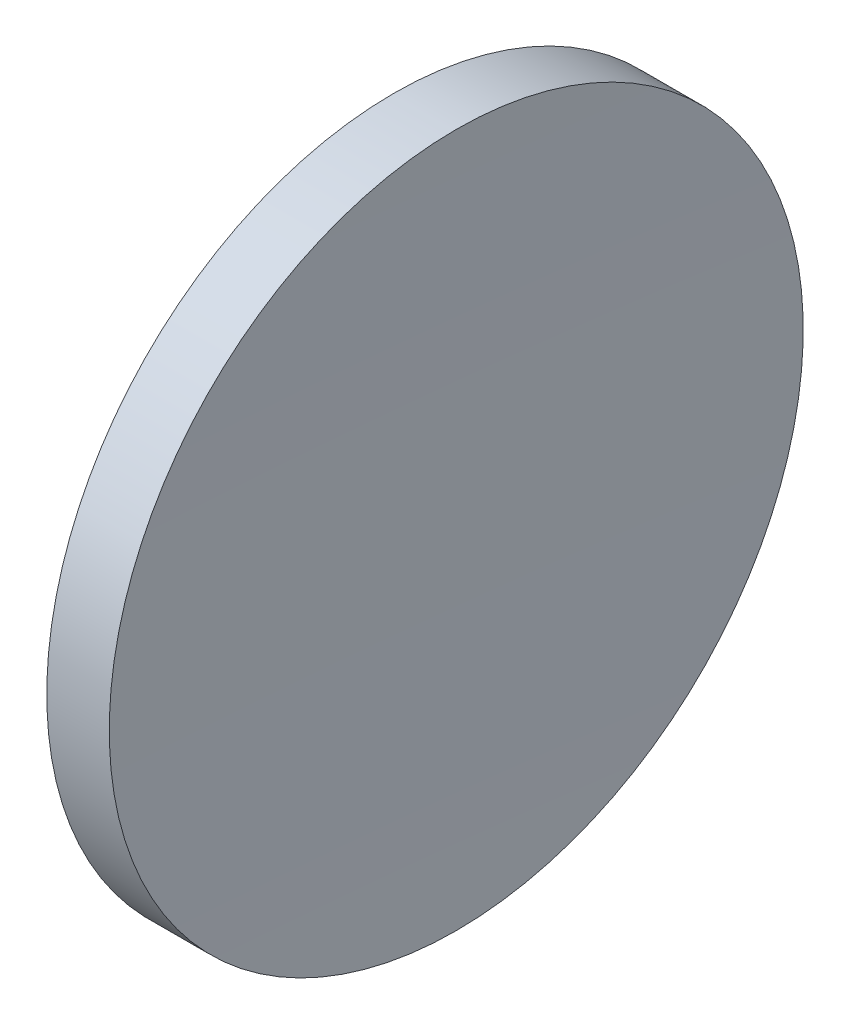
ISO-10303-21;
HEADER;
FILE_DESCRIPTION(('STEP AP214'),'2;1');
FILE_NAME('part.step','',(''),(''),'','','');
FILE_SCHEMA(('AUTOMOTIVE_DESIGN { 1 0 10303 214 1 1 1 1 }'));
ENDSEC;
DATA;
#1=APPLICATION_CONTEXT('core data for automotive mechanical design processes');
#2=APPLICATION_PROTOCOL_DEFINITION('international standard','automotive_design',2000,#1);
#3=PRODUCT_CONTEXT('',#1,'mechanical');
#4=PRODUCT('Part','Part','',(#3));
#5=PRODUCT_RELATED_PRODUCT_CATEGORY('part','',(#4));
#6=PRODUCT_DEFINITION_FORMATION('','',#4);
#7=PRODUCT_DEFINITION_CONTEXT('part definition',#1,'design');
#8=PRODUCT_DEFINITION('design','',#6,#7);
#9=PRODUCT_DEFINITION_SHAPE('','',#8);
#10=(LENGTH_UNIT() NAMED_UNIT(*) SI_UNIT(.MILLI.,.METRE.));
#11=(NAMED_UNIT(*) PLANE_ANGLE_UNIT() SI_UNIT($,.RADIAN.));
#12=(NAMED_UNIT(*) SI_UNIT($,.STERADIAN.) SOLID_ANGLE_UNIT());
#13=UNCERTAINTY_MEASURE_WITH_UNIT(LENGTH_MEASURE(1.E-05),#10,'distance_accuracy_value','');
#14=(GEOMETRIC_REPRESENTATION_CONTEXT(3) GLOBAL_UNCERTAINTY_ASSIGNED_CONTEXT((#13)) GLOBAL_UNIT_ASSIGNED_CONTEXT((#10,
#11,#12)) REPRESENTATION_CONTEXT('',''));
#15=CARTESIAN_POINT('',(0.,0.,0.));
#16=DIRECTION('',(0.,0.,1.));
#17=DIRECTION('',(1.,0.,0.));
#18=AXIS2_PLACEMENT_3D('',#15,#16,#17);
#19=CARTESIAN_POINT('',(-466.509556408487,52.1780822983919,0.));
#20=DIRECTION('',(-1.,0.,0.));
#21=DIRECTION('',(0.,1.,0.));
#22=AXIS2_PLACEMENT_3D('',#19,#20,#21);
#23=SPHERICAL_SURFACE('',#22,561.6);
#24=CARTESIAN_POINT('',(94.9468265813226,52.1780822983899,0.));
#25=DIRECTION('',(-1.,0.,0.));
#26=DIRECTION('',(0.,-1.,0.));
#27=AXIS2_PLACEMENT_3D('',#24,#25,#26);
#28=CIRCLE('',#27,12.7);
#29=CARTESIAN_POINT('',(94.9468265813226,39.4780822983899,0.));
#30=VERTEX_POINT('',#29);
#31=EDGE_CURVE('E41',#30,#30,#28,.T.);
#32=ORIENTED_EDGE('',*,*,#31,.T.);
#33=EDGE_LOOP('',(#32));
#34=FACE_BOUND('',#33,.T.);
#35=ADVANCED_FACE('F35',(#34),#23,.F.);
#36=CARTESIAN_POINT('',(658.690444345207,52.1780822983897,0.));
#37=DIRECTION('',(-1.,0.,0.));
#38=DIRECTION('',(0.,1.,0.));
#39=AXIS2_PLACEMENT_3D('',#36,#37,#38);
#40=SPHERICAL_SURFACE('',#39,561.6);
#41=CARTESIAN_POINT('',(97.2340613553972,52.1780822983899,0.));
#42=DIRECTION('',(-1.,0.,0.));
#43=DIRECTION('',(0.,-1.,0.));
#44=AXIS2_PLACEMENT_3D('',#41,#42,#43);
#45=CIRCLE('',#44,12.7000000000001);
#46=CARTESIAN_POINT('',(97.2340613553972,39.4780822983898,0.));
#47=VERTEX_POINT('',#46);
#48=EDGE_CURVE('E10',#47,#47,#45,.T.);
#49=ORIENTED_EDGE('',*,*,#48,.F.);
#50=EDGE_LOOP('',(#49));
#51=FACE_BOUND('',#50,.T.);
#52=ADVANCED_FACE('F50',(#51),#40,.F.);
#53=CARTESIAN_POINT('',(89.8586564536171,52.1780822983899,0.));
#54=DIRECTION('',(-1.,0.,0.));
#55=DIRECTION('',(0.,-1.,0.));
#56=AXIS2_PLACEMENT_3D('',#53,#54,#55);
#57=CYLINDRICAL_SURFACE('',#56,12.7);
#58=ORIENTED_EDGE('',*,*,#31,.F.);
#59=EDGE_LOOP('',(#58));
#60=FACE_BOUND('',#59,.T.);
#61=ORIENTED_EDGE('',*,*,#48,.T.);
#62=EDGE_LOOP('',(#61));
#63=FACE_BOUND('',#62,.T.);
#64=ADVANCED_FACE('F48',(#60,#63),#57,.T.);
#65=CLOSED_SHELL('',(#35,#52,#64));
#66=MANIFOLD_SOLID_BREP('B2',#65);
#67=ADVANCED_BREP_SHAPE_REPRESENTATION('',(#18,#66),#14);
#68=SHAPE_DEFINITION_REPRESENTATION(#9,#67);
ENDSEC;
END-ISO-10303-21;
